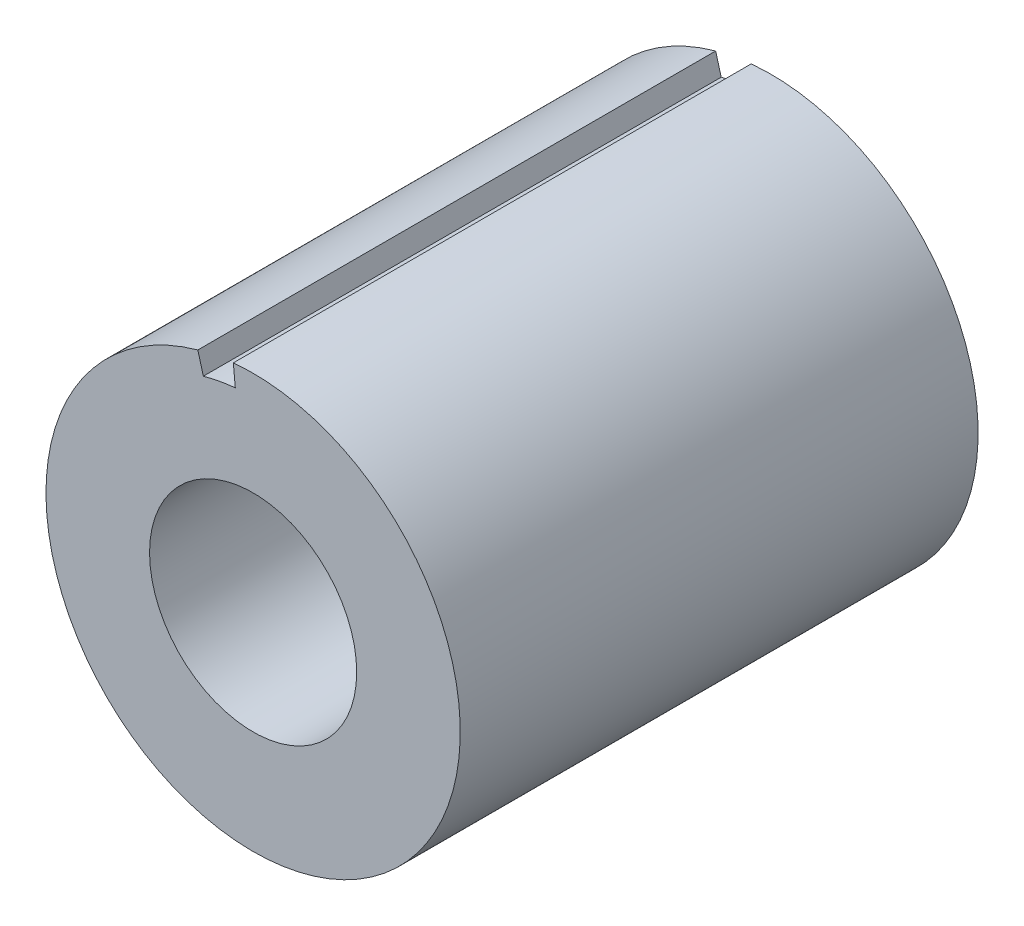
ISO-10303-21;
HEADER;
FILE_DESCRIPTION(('STEP AP214'),'2;1');
FILE_NAME('part.step','',(''),(''),'','','');
FILE_SCHEMA(('AUTOMOTIVE_DESIGN { 1 0 10303 214 1 1 1 1 }'));
ENDSEC;
DATA;
#1=APPLICATION_CONTEXT('core data for automotive mechanical design processes');
#2=APPLICATION_PROTOCOL_DEFINITION('international standard','automotive_design',2000,#1);
#3=PRODUCT_CONTEXT('',#1,'mechanical');
#4=PRODUCT('Part','Part','',(#3));
#5=PRODUCT_RELATED_PRODUCT_CATEGORY('part','',(#4));
#6=PRODUCT_DEFINITION_FORMATION('','',#4);
#7=PRODUCT_DEFINITION_CONTEXT('part definition',#1,'design');
#8=PRODUCT_DEFINITION('design','',#6,#7);
#9=PRODUCT_DEFINITION_SHAPE('','',#8);
#10=(LENGTH_UNIT() NAMED_UNIT(*) SI_UNIT(.MILLI.,.METRE.));
#11=(NAMED_UNIT(*) PLANE_ANGLE_UNIT() SI_UNIT($,.RADIAN.));
#12=(NAMED_UNIT(*) SI_UNIT($,.STERADIAN.) SOLID_ANGLE_UNIT());
#13=UNCERTAINTY_MEASURE_WITH_UNIT(LENGTH_MEASURE(1.E-05),#10,'distance_accuracy_value','');
#14=(GEOMETRIC_REPRESENTATION_CONTEXT(3) GLOBAL_UNCERTAINTY_ASSIGNED_CONTEXT((#13)) GLOBAL_UNIT_ASSIGNED_CONTEXT((#10,
#11,#12)) REPRESENTATION_CONTEXT('',''));
#15=CARTESIAN_POINT('',(0.,0.,0.));
#16=DIRECTION('',(0.,0.,1.));
#17=DIRECTION('',(1.,0.,0.));
#18=AXIS2_PLACEMENT_3D('',#15,#16,#17);
#19=CARTESIAN_POINT('',(0.,0.,10.));
#20=DIRECTION('',(0.,0.,1.));
#21=DIRECTION('',(1.,0.,0.));
#22=AXIS2_PLACEMENT_3D('',#19,#20,#21);
#23=PLANE('',#22);
#24=DIRECTION('',(0.26697043151888,-0.963704720697488,0.));
#25=VECTOR('',#24,1.);
#26=CARTESIAN_POINT('',(-0.961093553467968,3.46933699451096,10.));
#27=LINE('',#26,#25);
#28=CARTESIAN_POINT('',(-1.06788172607552,3.85481888278995,10.));
#29=VERTEX_POINT('',#28);
#30=CARTESIAN_POINT('',(-0.961093553467968,3.46933699451096,10.));
#31=VERTEX_POINT('',#30);
#32=EDGE_CURVE('E87',#29,#31,#27,.T.);
#33=ORIENTED_EDGE('',*,*,#32,.F.);
#34=CARTESIAN_POINT('',(0.,0.,10.));
#35=DIRECTION('',(0.,0.,1.));
#36=DIRECTION('',(1.,0.,0.));
#37=AXIS2_PLACEMENT_3D('',#34,#35,#36);
#38=CIRCLE('',#37,4.);
#39=CARTESIAN_POINT('',(-0.382275928906711,3.98169123792623,10.));
#40=VERTEX_POINT('',#39);
#41=EDGE_CURVE('E100',#29,#40,#38,.T.);
#42=ORIENTED_EDGE('',*,*,#41,.T.);
#43=DIRECTION('',(-0.0955689822266779,0.995422809481557,0.));
#44=VECTOR('',#43,1.);
#45=CARTESIAN_POINT('',(-0.512466107906491,5.33771984393865,10.));
#46=LINE('',#45,#44);
#47=CARTESIAN_POINT('',(-0.34404833601604,3.58352211413361,10.));
#48=VERTEX_POINT('',#47);
#49=EDGE_CURVE('E54',#48,#40,#46,.T.);
#50=ORIENTED_EDGE('',*,*,#49,.F.);
#51=CARTESIAN_POINT('',(0.,0.,10.));
#52=DIRECTION('',(0.,0.,-1.));
#53=DIRECTION('',(1.,0.,0.));
#54=AXIS2_PLACEMENT_3D('',#51,#52,#53);
#55=CIRCLE('',#54,3.6);
#56=EDGE_CURVE('E90',#31,#48,#55,.T.);
#57=ORIENTED_EDGE('',*,*,#56,.F.);
#58=EDGE_LOOP('',(#33,#42,#50,#57));
#59=FACE_BOUND('',#58,.T.);
#60=CARTESIAN_POINT('',(0.,0.,10.));
#61=DIRECTION('',(0.,0.,1.));
#62=DIRECTION('',(1.,0.,0.));
#63=AXIS2_PLACEMENT_3D('',#60,#61,#62);
#64=CIRCLE('',#63,2.);
#65=CARTESIAN_POINT('',(2.,0.,10.));
#66=VERTEX_POINT('',#65);
#67=EDGE_CURVE('E113',#66,#66,#64,.T.);
#68=ORIENTED_EDGE('',*,*,#67,.F.);
#69=EDGE_LOOP('',(#68));
#70=FACE_BOUND('',#69,.T.);
#71=ADVANCED_FACE('F38',(#59,#70),#23,.T.);
#72=CARTESIAN_POINT('',(0.,0.,0.));
#73=DIRECTION('',(0.,0.,1.));
#74=DIRECTION('',(1.,0.,0.));
#75=AXIS2_PLACEMENT_3D('',#72,#73,#74);
#76=PLANE('',#75);
#77=CARTESIAN_POINT('',(0.,0.,0.));
#78=DIRECTION('',(0.,0.,1.));
#79=DIRECTION('',(1.,0.,0.));
#80=AXIS2_PLACEMENT_3D('',#77,#78,#79);
#81=CIRCLE('',#80,4.);
#82=CARTESIAN_POINT('',(-1.06788172607552,3.85481888278995,0.));
#83=VERTEX_POINT('',#82);
#84=CARTESIAN_POINT('',(-0.382275928906712,3.98169123792623,0.));
#85=VERTEX_POINT('',#84);
#86=EDGE_CURVE('E117',#83,#85,#81,.T.);
#87=ORIENTED_EDGE('',*,*,#86,.F.);
#88=DIRECTION('',(0.26697043151888,-0.963704720697488,0.));
#89=VECTOR('',#88,1.);
#90=CARTESIAN_POINT('',(0.,0.,0.));
#91=LINE('',#90,#89);
#92=CARTESIAN_POINT('',(-0.961093553467968,3.46933699451096,0.));
#93=VERTEX_POINT('',#92);
#94=EDGE_CURVE('E62',#83,#93,#91,.T.);
#95=ORIENTED_EDGE('',*,*,#94,.T.);
#96=CARTESIAN_POINT('',(0.,0.,0.));
#97=DIRECTION('',(0.,0.,1.));
#98=DIRECTION('',(1.,0.,0.));
#99=AXIS2_PLACEMENT_3D('',#96,#97,#98);
#100=CIRCLE('',#99,3.6);
#101=CARTESIAN_POINT('',(-0.34404833601604,3.58352211413361,0.));
#102=VERTEX_POINT('',#101);
#103=EDGE_CURVE('E11',#93,#102,#100,.F.);
#104=ORIENTED_EDGE('',*,*,#103,.T.);
#105=DIRECTION('',(-0.0955689822266779,0.995422809481558,0.));
#106=VECTOR('',#105,1.);
#107=CARTESIAN_POINT('',(0.,0.,0.));
#108=LINE('',#107,#106);
#109=EDGE_CURVE('E83',#102,#85,#108,.T.);
#110=ORIENTED_EDGE('',*,*,#109,.T.);
#111=EDGE_LOOP('',(#87,#95,#104,#110));
#112=FACE_BOUND('',#111,.T.);
#113=CARTESIAN_POINT('',(0.,0.,0.));
#114=DIRECTION('',(0.,0.,1.));
#115=DIRECTION('',(1.,0.,0.));
#116=AXIS2_PLACEMENT_3D('',#113,#114,#115);
#117=CIRCLE('',#116,2.);
#118=CARTESIAN_POINT('',(2.,0.,0.));
#119=VERTEX_POINT('',#118);
#120=EDGE_CURVE('E112',#119,#119,#117,.T.);
#121=ORIENTED_EDGE('',*,*,#120,.T.);
#122=EDGE_LOOP('',(#121));
#123=FACE_BOUND('',#122,.T.);
#124=ADVANCED_FACE('F132',(#112,#123),#76,.F.);
#125=CARTESIAN_POINT('',(0.,0.,10.));
#126=DIRECTION('',(0.,0.,-1.));
#127=DIRECTION('',(-1.,0.,0.));
#128=AXIS2_PLACEMENT_3D('',#125,#126,#127);
#129=CYLINDRICAL_SURFACE('',#128,4.);
#130=ORIENTED_EDGE('',*,*,#41,.F.);
#131=DIRECTION('',(0.,0.,-1.));
#132=VECTOR('',#131,1.);
#133=CARTESIAN_POINT('',(-1.06788172607552,3.85481888278995,10.));
#134=LINE('',#133,#132);
#135=EDGE_CURVE('E47',#29,#83,#134,.T.);
#136=ORIENTED_EDGE('',*,*,#135,.T.);
#137=ORIENTED_EDGE('',*,*,#86,.T.);
#138=DIRECTION('',(0.,0.,-1.));
#139=VECTOR('',#138,1.);
#140=CARTESIAN_POINT('',(-0.382275928906712,3.98169123792623,10.));
#141=LINE('',#140,#139);
#142=EDGE_CURVE('E123',#85,#40,#141,.F.);
#143=ORIENTED_EDGE('',*,*,#142,.T.);
#144=EDGE_LOOP('',(#130,#136,#137,#143));
#145=FACE_BOUND('',#144,.T.);
#146=ADVANCED_FACE('F40',(#145),#129,.T.);
#147=CARTESIAN_POINT('',(0.,0.,10.));
#148=DIRECTION('',(0.,0.,-1.));
#149=DIRECTION('',(-1.,0.,0.));
#150=AXIS2_PLACEMENT_3D('',#147,#148,#149);
#151=CYLINDRICAL_SURFACE('',#150,2.);
#152=ORIENTED_EDGE('',*,*,#67,.T.);
#153=EDGE_LOOP('',(#152));
#154=FACE_BOUND('',#153,.T.);
#155=ORIENTED_EDGE('',*,*,#120,.F.);
#156=EDGE_LOOP('',(#155));
#157=FACE_BOUND('',#156,.T.);
#158=ADVANCED_FACE('F142',(#154,#157),#151,.F.);
#159=CARTESIAN_POINT('',(0.,0.,-0.999999999999999));
#160=DIRECTION('',(0.,0.,1.));
#161=DIRECTION('',(1.,0.,0.));
#162=AXIS2_PLACEMENT_3D('',#159,#160,#161);
#163=CYLINDRICAL_SURFACE('',#162,3.6);
#164=DIRECTION('',(0.,0.,1.));
#165=VECTOR('',#164,1.);
#166=CARTESIAN_POINT('',(-0.961093553467968,3.46933699451096,-0.999999999999999));
#167=LINE('',#166,#165);
#168=EDGE_CURVE('E86',#93,#31,#167,.T.);
#169=ORIENTED_EDGE('',*,*,#168,.T.);
#170=ORIENTED_EDGE('',*,*,#56,.T.);
#171=DIRECTION('',(0.,0.,1.));
#172=VECTOR('',#171,1.);
#173=CARTESIAN_POINT('',(-0.34404833601604,3.58352211413361,-0.999999999999999));
#174=LINE('',#173,#172);
#175=EDGE_CURVE('E79',#102,#48,#174,.T.);
#176=ORIENTED_EDGE('',*,*,#175,.F.);
#177=ORIENTED_EDGE('',*,*,#103,.F.);
#178=EDGE_LOOP('',(#169,#170,#176,#177));
#179=FACE_BOUND('',#178,.T.);
#180=ADVANCED_FACE('F91',(#179),#163,.T.);
#181=CARTESIAN_POINT('',(-0.961093553467968,3.46933699451096,-0.999999999999999));
#182=DIRECTION('',(-0.963704720697488,-0.26697043151888,0.));
#183=DIRECTION('',(0.26697043151888,-0.963704720697488,0.));
#184=AXIS2_PLACEMENT_3D('',#181,#182,#183);
#185=PLANE('',#184);
#186=ORIENTED_EDGE('',*,*,#135,.F.);
#187=ORIENTED_EDGE('',*,*,#32,.T.);
#188=ORIENTED_EDGE('',*,*,#168,.F.);
#189=ORIENTED_EDGE('',*,*,#94,.F.);
#190=EDGE_LOOP('',(#186,#187,#188,#189));
#191=FACE_BOUND('',#190,.T.);
#192=ADVANCED_FACE('F134',(#191),#185,.F.);
#193=CARTESIAN_POINT('',(-0.512466107906491,5.33771984393865,-0.999999999999999));
#194=DIRECTION('',(0.995422809481557,0.0955689822266779,0.));
#195=DIRECTION('',(-0.0955689822266779,0.995422809481558,0.));
#196=AXIS2_PLACEMENT_3D('',#193,#194,#195);
#197=PLANE('',#196);
#198=ORIENTED_EDGE('',*,*,#175,.T.);
#199=ORIENTED_EDGE('',*,*,#49,.T.);
#200=ORIENTED_EDGE('',*,*,#142,.F.);
#201=ORIENTED_EDGE('',*,*,#109,.F.);
#202=EDGE_LOOP('',(#198,#199,#200,#201));
#203=FACE_BOUND('',#202,.T.);
#204=ADVANCED_FACE('F81',(#203),#197,.F.);
#205=CLOSED_SHELL('',(#71,#124,#146,#158,#180,#192,#204));
#206=MANIFOLD_SOLID_BREP('B2',#205);
#207=ADVANCED_BREP_SHAPE_REPRESENTATION('',(#18,#206),#14);
#208=SHAPE_DEFINITION_REPRESENTATION(#9,#207);
ENDSEC;
END-ISO-10303-21;
